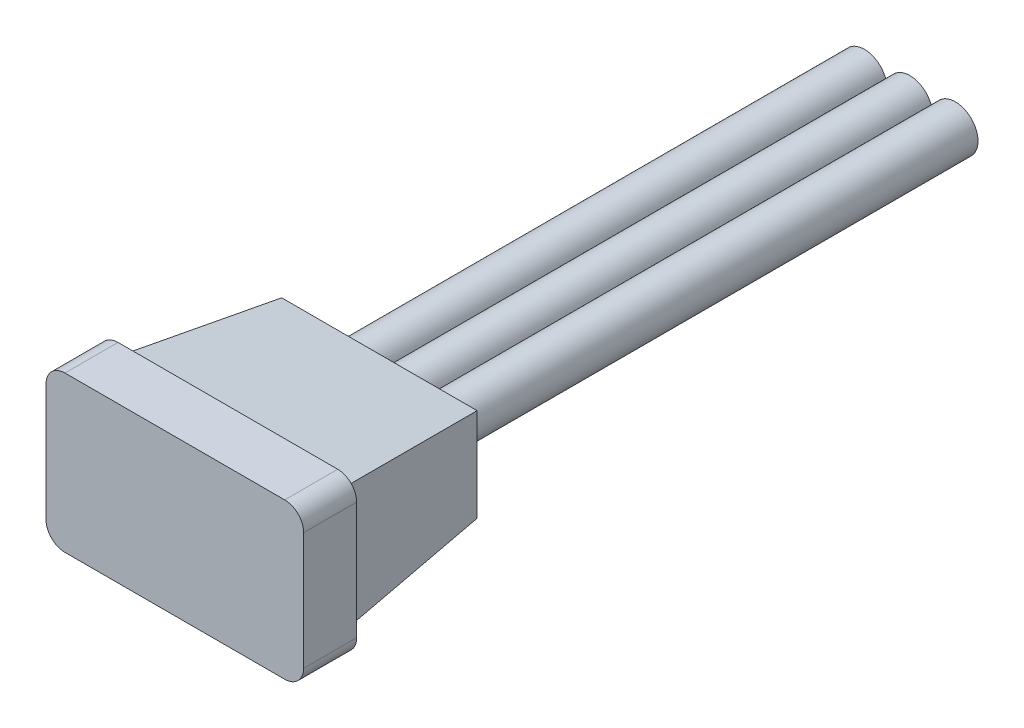
ISO-10303-21;
HEADER;
FILE_DESCRIPTION(('STEP AP214'),'2;1');
FILE_NAME('part.step','',(''),(''),'','','');
FILE_SCHEMA(('AUTOMOTIVE_DESIGN { 1 0 10303 214 1 1 1 1 }'));
ENDSEC;
DATA;
#1=APPLICATION_CONTEXT('core data for automotive mechanical design processes');
#2=APPLICATION_PROTOCOL_DEFINITION('international standard','automotive_design',2000,#1);
#3=PRODUCT_CONTEXT('',#1,'mechanical');
#4=PRODUCT('Part','Part','',(#3));
#5=PRODUCT_RELATED_PRODUCT_CATEGORY('part','',(#4));
#6=PRODUCT_DEFINITION_FORMATION('','',#4);
#7=PRODUCT_DEFINITION_CONTEXT('part definition',#1,'design');
#8=PRODUCT_DEFINITION('design','',#6,#7);
#9=PRODUCT_DEFINITION_SHAPE('','',#8);
#10=(LENGTH_UNIT() NAMED_UNIT(*) SI_UNIT(.MILLI.,.METRE.));
#11=(NAMED_UNIT(*) PLANE_ANGLE_UNIT() SI_UNIT($,.RADIAN.));
#12=(NAMED_UNIT(*) SI_UNIT($,.STERADIAN.) SOLID_ANGLE_UNIT());
#13=UNCERTAINTY_MEASURE_WITH_UNIT(LENGTH_MEASURE(1.E-05),#10,'distance_accuracy_value','');
#14=(GEOMETRIC_REPRESENTATION_CONTEXT(3) GLOBAL_UNCERTAINTY_ASSIGNED_CONTEXT((#13)) GLOBAL_UNIT_ASSIGNED_CONTEXT((#10,
#11,#12)) REPRESENTATION_CONTEXT('',''));
#15=CARTESIAN_POINT('',(0.,0.,0.));
#16=DIRECTION('',(0.,0.,1.));
#17=DIRECTION('',(1.,0.,0.));
#18=AXIS2_PLACEMENT_3D('',#15,#16,#17);
#19=CARTESIAN_POINT('',(1.2,0.,-21.0970562748477));
#20=DIRECTION('',(0.,0.,1.));
#21=DIRECTION('',(1.,0.,0.));
#22=AXIS2_PLACEMENT_3D('',#19,#20,#21);
#23=CYLINDRICAL_SURFACE('',#22,0.6);
#24=CARTESIAN_POINT('',(1.2,0.,-5.4));
#25=DIRECTION('',(0.,0.,-1.));
#26=DIRECTION('',(-1.,0.,0.));
#27=AXIS2_PLACEMENT_3D('',#24,#25,#26);
#28=CIRCLE('',#27,0.6);
#29=CARTESIAN_POINT('',(0.6,0.,-5.4));
#30=VERTEX_POINT('',#29);
#31=EDGE_CURVE('E47',#30,#30,#28,.T.);
#32=ORIENTED_EDGE('',*,*,#31,.T.);
#33=EDGE_LOOP('',(#32));
#34=FACE_BOUND('',#33,.T.);
#35=CARTESIAN_POINT('',(1.2,0.,-19.4));
#36=DIRECTION('',(0.,0.,-1.));
#37=DIRECTION('',(-1.,0.,0.));
#38=AXIS2_PLACEMENT_3D('',#35,#36,#37);
#39=CIRCLE('',#38,0.6);
#40=CARTESIAN_POINT('',(0.6,0.,-19.4));
#41=VERTEX_POINT('',#40);
#42=EDGE_CURVE('E11',#41,#41,#39,.T.);
#43=ORIENTED_EDGE('',*,*,#42,.F.);
#44=EDGE_LOOP('',(#43));
#45=FACE_BOUND('',#44,.T.);
#46=ADVANCED_FACE('F40',(#34,#45),#23,.T.);
#47=CARTESIAN_POINT('',(1.2,0.,-5.4));
#48=DIRECTION('',(0.,0.,-1.));
#49=DIRECTION('',(-1.,0.,0.));
#50=AXIS2_PLACEMENT_3D('',#47,#48,#49);
#51=PLANE('',#50);
#52=ORIENTED_EDGE('',*,*,#31,.F.);
#53=EDGE_LOOP('',(#52));
#54=FACE_BOUND('',#53,.T.);
#55=ADVANCED_FACE('F55',(#54),#51,.F.);
#56=CARTESIAN_POINT('',(0.,0.,-19.4));
#57=DIRECTION('',(0.,0.,-1.));
#58=DIRECTION('',(-1.,0.,0.));
#59=AXIS2_PLACEMENT_3D('',#56,#57,#58);
#60=PLANE('',#59);
#61=ORIENTED_EDGE('',*,*,#42,.T.);
#62=EDGE_LOOP('',(#61));
#63=FACE_BOUND('',#62,.T.);
#64=ADVANCED_FACE('F42',(#63),#60,.T.);
#65=CLOSED_SHELL('',(#46,#55,#64));
#66=MANIFOLD_SOLID_BREP('B2',#65);
#67=CARTESIAN_POINT('',(-1.2,0.,-21.0970562748477));
#68=DIRECTION('',(0.,0.,1.));
#69=DIRECTION('',(1.,0.,0.));
#70=AXIS2_PLACEMENT_3D('',#67,#68,#69);
#71=CYLINDRICAL_SURFACE('',#70,0.6);
#72=CARTESIAN_POINT('',(-1.2,0.,-5.4));
#73=DIRECTION('',(0.,0.,-1.));
#74=DIRECTION('',(-1.,0.,0.));
#75=AXIS2_PLACEMENT_3D('',#72,#73,#74);
#76=CIRCLE('',#75,0.6);
#77=CARTESIAN_POINT('',(-1.8,0.,-5.4));
#78=VERTEX_POINT('',#77);
#79=EDGE_CURVE('E96',#78,#78,#76,.T.);
#80=ORIENTED_EDGE('',*,*,#79,.T.);
#81=EDGE_LOOP('',(#80));
#82=FACE_BOUND('',#81,.T.);
#83=CARTESIAN_POINT('',(-1.2,0.,-19.4));
#84=DIRECTION('',(0.,0.,-1.));
#85=DIRECTION('',(-1.,0.,0.));
#86=AXIS2_PLACEMENT_3D('',#83,#84,#85);
#87=CIRCLE('',#86,0.6);
#88=CARTESIAN_POINT('',(-1.8,0.,-19.4));
#89=VERTEX_POINT('',#88);
#90=EDGE_CURVE('E39',#89,#89,#87,.T.);
#91=ORIENTED_EDGE('',*,*,#90,.F.);
#92=EDGE_LOOP('',(#91));
#93=FACE_BOUND('',#92,.T.);
#94=ADVANCED_FACE('F89',(#82,#93),#71,.T.);
#95=CARTESIAN_POINT('',(-1.2,0.,-5.4));
#96=DIRECTION('',(0.,0.,-1.));
#97=DIRECTION('',(-1.,0.,0.));
#98=AXIS2_PLACEMENT_3D('',#95,#96,#97);
#99=PLANE('',#98);
#100=ORIENTED_EDGE('',*,*,#79,.F.);
#101=EDGE_LOOP('',(#100));
#102=FACE_BOUND('',#101,.T.);
#103=ADVANCED_FACE('F104',(#102),#99,.F.);
#104=CARTESIAN_POINT('',(0.,0.,-19.4));
#105=DIRECTION('',(0.,0.,-1.));
#106=DIRECTION('',(-1.,0.,0.));
#107=AXIS2_PLACEMENT_3D('',#104,#105,#106);
#108=PLANE('',#107);
#109=ORIENTED_EDGE('',*,*,#90,.T.);
#110=EDGE_LOOP('',(#109));
#111=FACE_BOUND('',#110,.T.);
#112=ADVANCED_FACE('F91',(#111),#108,.T.);
#113=CLOSED_SHELL('',(#94,#103,#112));
#114=MANIFOLD_SOLID_BREP('B6',#113);
#115=CARTESIAN_POINT('',(0.,0.,-19.4));
#116=DIRECTION('',(0.,0.,1.));
#117=DIRECTION('',(1.,0.,0.));
#118=AXIS2_PLACEMENT_3D('',#115,#116,#117);
#119=CYLINDRICAL_SURFACE('',#118,0.6);
#120=CARTESIAN_POINT('',(0.,0.,-19.4));
#121=DIRECTION('',(0.,0.,-1.));
#122=DIRECTION('',(-1.,0.,0.));
#123=AXIS2_PLACEMENT_3D('',#120,#121,#122);
#124=CIRCLE('',#123,0.6);
#125=CARTESIAN_POINT('',(-0.6,0.,-19.4));
#126=VERTEX_POINT('',#125);
#127=EDGE_CURVE('E88',#126,#126,#124,.T.);
#128=ORIENTED_EDGE('',*,*,#127,.F.);
#129=EDGE_LOOP('',(#128));
#130=FACE_BOUND('',#129,.T.);
#131=CARTESIAN_POINT('',(0.,0.,-5.4));
#132=DIRECTION('',(0.,0.,-1.));
#133=DIRECTION('',(-1.,0.,0.));
#134=AXIS2_PLACEMENT_3D('',#131,#132,#133);
#135=CIRCLE('',#134,0.6);
#136=CARTESIAN_POINT('',(-0.6,0.,-5.4));
#137=VERTEX_POINT('',#136);
#138=EDGE_CURVE('E142',#137,#137,#135,.T.);
#139=ORIENTED_EDGE('',*,*,#138,.T.);
#140=EDGE_LOOP('',(#139));
#141=FACE_BOUND('',#140,.T.);
#142=ADVANCED_FACE('F139',(#130,#141),#119,.T.);
#143=CARTESIAN_POINT('',(0.,0.,-19.4));
#144=DIRECTION('',(0.,0.,-1.));
#145=DIRECTION('',(-1.,0.,0.));
#146=AXIS2_PLACEMENT_3D('',#143,#144,#145);
#147=PLANE('',#146);
#148=ORIENTED_EDGE('',*,*,#127,.T.);
#149=EDGE_LOOP('',(#148));
#150=FACE_BOUND('',#149,.T.);
#151=ADVANCED_FACE('F154',(#150),#147,.T.);
#152=CARTESIAN_POINT('',(0.,0.,-5.4));
#153=DIRECTION('',(0.,0.,-1.));
#154=DIRECTION('',(-1.,0.,0.));
#155=AXIS2_PLACEMENT_3D('',#152,#153,#154);
#156=PLANE('',#155);
#157=ORIENTED_EDGE('',*,*,#138,.F.);
#158=EDGE_LOOP('',(#157));
#159=FACE_BOUND('',#158,.T.);
#160=ADVANCED_FACE('F152',(#159),#156,.F.);
#161=CLOSED_SHELL('',(#142,#151,#160));
#162=MANIFOLD_SOLID_BREP('B34',#161);
#163=CARTESIAN_POINT('',(0.,0.,-1.4));
#164=DIRECTION('',(0.,0.,1.));
#165=DIRECTION('',(1.,0.,0.));
#166=AXIS2_PLACEMENT_3D('',#163,#164,#165);
#167=PLANE('',#166);
#168=DIRECTION('',(1.,0.,0.));
#169=VECTOR('',#168,1.);
#170=CARTESIAN_POINT('',(-3.4,-2.05,-1.4));
#171=LINE('',#170,#169);
#172=CARTESIAN_POINT('',(-2.9,-2.05,-1.4));
#173=VERTEX_POINT('',#172);
#174=CARTESIAN_POINT('',(2.9,-2.05,-1.4));
#175=VERTEX_POINT('',#174);
#176=EDGE_CURVE('E318',#173,#175,#171,.T.);
#177=ORIENTED_EDGE('',*,*,#176,.F.);
#178=CARTESIAN_POINT('',(-2.9,-1.55,-1.4));
#179=DIRECTION('',(0.,0.,1.));
#180=DIRECTION('',(1.,0.,0.));
#181=AXIS2_PLACEMENT_3D('',#178,#179,#180);
#182=CIRCLE('',#181,0.5);
#183=CARTESIAN_POINT('',(-3.4,-1.55,-1.4));
#184=VERTEX_POINT('',#183);
#185=EDGE_CURVE('E355',#173,#184,#182,.F.);
#186=ORIENTED_EDGE('',*,*,#185,.T.);
#187=DIRECTION('',(0.,-1.,0.));
#188=VECTOR('',#187,1.);
#189=CARTESIAN_POINT('',(-3.4,2.05,-1.4));
#190=LINE('',#189,#188);
#191=CARTESIAN_POINT('',(-3.4,1.55,-1.4));
#192=VERTEX_POINT('',#191);
#193=EDGE_CURVE('E315',#192,#184,#190,.T.);
#194=ORIENTED_EDGE('',*,*,#193,.F.);
#195=CARTESIAN_POINT('',(-2.9,1.55,-1.4));
#196=DIRECTION('',(0.,0.,1.));
#197=DIRECTION('',(1.,0.,0.));
#198=AXIS2_PLACEMENT_3D('',#195,#196,#197);
#199=CIRCLE('',#198,0.5);
#200=CARTESIAN_POINT('',(-2.9,2.05,-1.4));
#201=VERTEX_POINT('',#200);
#202=EDGE_CURVE('E195',#192,#201,#199,.F.);
#203=ORIENTED_EDGE('',*,*,#202,.T.);
#204=DIRECTION('',(-1.,0.,0.));
#205=VECTOR('',#204,1.);
#206=CARTESIAN_POINT('',(-3.4,2.05,-1.4));
#207=LINE('',#206,#205);
#208=CARTESIAN_POINT('',(2.9,2.05,-1.4));
#209=VERTEX_POINT('',#208);
#210=EDGE_CURVE('E312',#209,#201,#207,.T.);
#211=ORIENTED_EDGE('',*,*,#210,.F.);
#212=CARTESIAN_POINT('',(2.9,1.55,-1.4));
#213=DIRECTION('',(0.,0.,1.));
#214=DIRECTION('',(1.,0.,0.));
#215=AXIS2_PLACEMENT_3D('',#212,#213,#214);
#216=CIRCLE('',#215,0.5);
#217=CARTESIAN_POINT('',(3.4,1.55,-1.4));
#218=VERTEX_POINT('',#217);
#219=EDGE_CURVE('E350',#209,#218,#216,.F.);
#220=ORIENTED_EDGE('',*,*,#219,.T.);
#221=DIRECTION('',(0.,1.,0.));
#222=VECTOR('',#221,1.);
#223=CARTESIAN_POINT('',(3.4,2.05,-1.4));
#224=LINE('',#223,#222);
#225=CARTESIAN_POINT('',(3.4,-1.55,-1.4));
#226=VERTEX_POINT('',#225);
#227=EDGE_CURVE('E309',#226,#218,#224,.T.);
#228=ORIENTED_EDGE('',*,*,#227,.F.);
#229=CARTESIAN_POINT('',(2.9,-1.55,-1.4));
#230=DIRECTION('',(0.,0.,1.));
#231=DIRECTION('',(1.,0.,0.));
#232=AXIS2_PLACEMENT_3D('',#229,#230,#231);
#233=CIRCLE('',#232,0.5);
#234=EDGE_CURVE('E352',#226,#175,#233,.F.);
#235=ORIENTED_EDGE('',*,*,#234,.T.);
#236=EDGE_LOOP('',(#177,#186,#194,#203,#211,#220,#228,#235));
#237=FACE_BOUND('',#236,.T.);
#238=DIRECTION('',(0.,-1.,0.));
#239=VECTOR('',#238,1.);
#240=CARTESIAN_POINT('',(3.,1.65,-1.4));
#241=LINE('',#240,#239);
#242=CARTESIAN_POINT('',(3.,1.65,-1.4));
#243=VERTEX_POINT('',#242);
#244=CARTESIAN_POINT('',(3.,-1.65,-1.4));
#245=VERTEX_POINT('',#244);
#246=EDGE_CURVE('E269',#243,#245,#241,.T.);
#247=ORIENTED_EDGE('',*,*,#246,.F.);
#248=DIRECTION('',(1.,0.,0.));
#249=VECTOR('',#248,1.);
#250=CARTESIAN_POINT('',(-3.,1.65,-1.4));
#251=LINE('',#250,#249);
#252=CARTESIAN_POINT('',(-3.,1.65,-1.4));
#253=VERTEX_POINT('',#252);
#254=EDGE_CURVE('E271',#253,#243,#251,.T.);
#255=ORIENTED_EDGE('',*,*,#254,.F.);
#256=DIRECTION('',(0.,1.,0.));
#257=VECTOR('',#256,1.);
#258=CARTESIAN_POINT('',(-3.,1.65,-1.4));
#259=LINE('',#258,#257);
#260=CARTESIAN_POINT('',(-3.,-1.65,-1.4));
#261=VERTEX_POINT('',#260);
#262=EDGE_CURVE('E290',#261,#253,#259,.T.);
#263=ORIENTED_EDGE('',*,*,#262,.F.);
#264=DIRECTION('',(-1.,0.,0.));
#265=VECTOR('',#264,1.);
#266=CARTESIAN_POINT('',(-3.,-1.65,-1.4));
#267=LINE('',#266,#265);
#268=EDGE_CURVE('E274',#245,#261,#267,.T.);
#269=ORIENTED_EDGE('',*,*,#268,.F.);
#270=EDGE_LOOP('',(#247,#255,#263,#269));
#271=FACE_BOUND('',#270,.T.);
#272=ADVANCED_FACE('F180',(#237,#271),#167,.F.);
#273=CARTESIAN_POINT('',(3.4,2.05,-1.4));
#274=DIRECTION('',(1.,0.,0.));
#275=DIRECTION('',(0.,1.,0.));
#276=AXIS2_PLACEMENT_3D('',#273,#274,#275);
#277=PLANE('',#276);
#278=DIRECTION('',(0.,1.,0.));
#279=VECTOR('',#278,1.);
#280=CARTESIAN_POINT('',(3.4,2.05,0.));
#281=LINE('',#280,#279);
#282=CARTESIAN_POINT('',(3.4,-1.55,0.));
#283=VERTEX_POINT('',#282);
#284=CARTESIAN_POINT('',(3.4,1.55,0.));
#285=VERTEX_POINT('',#284);
#286=EDGE_CURVE('E322',#283,#285,#281,.T.);
#287=ORIENTED_EDGE('',*,*,#286,.F.);
#288=DIRECTION('',(0.,0.,1.));
#289=VECTOR('',#288,1.);
#290=CARTESIAN_POINT('',(3.4,-1.55,-1.4));
#291=LINE('',#290,#289);
#292=EDGE_CURVE('E137',#283,#226,#291,.F.);
#293=ORIENTED_EDGE('',*,*,#292,.T.);
#294=ORIENTED_EDGE('',*,*,#227,.T.);
#295=DIRECTION('',(0.,0.,1.));
#296=VECTOR('',#295,1.);
#297=CARTESIAN_POINT('',(3.4,1.55,-1.4));
#298=LINE('',#297,#296);
#299=EDGE_CURVE('E188',#218,#285,#298,.T.);
#300=ORIENTED_EDGE('',*,*,#299,.T.);
#301=EDGE_LOOP('',(#287,#293,#294,#300));
#302=FACE_BOUND('',#301,.T.);
#303=ADVANCED_FACE('F364',(#302),#277,.T.);
#304=CARTESIAN_POINT('',(-3.4,-2.05,-1.4));
#305=DIRECTION('',(0.,-1.,0.));
#306=DIRECTION('',(0.,0.,-1.));
#307=AXIS2_PLACEMENT_3D('',#304,#305,#306);
#308=PLANE('',#307);
#309=DIRECTION('',(1.,0.,0.));
#310=VECTOR('',#309,1.);
#311=CARTESIAN_POINT('',(-3.4,-2.05,0.));
#312=LINE('',#311,#310);
#313=CARTESIAN_POINT('',(-2.9,-2.05,0.));
#314=VERTEX_POINT('',#313);
#315=CARTESIAN_POINT('',(2.9,-2.05,0.));
#316=VERTEX_POINT('',#315);
#317=EDGE_CURVE('E313',#314,#316,#312,.T.);
#318=ORIENTED_EDGE('',*,*,#317,.F.);
#319=DIRECTION('',(0.,0.,1.));
#320=VECTOR('',#319,1.);
#321=CARTESIAN_POINT('',(-2.9,-2.05,-1.4));
#322=LINE('',#321,#320);
#323=EDGE_CURVE('E348',#314,#173,#322,.F.);
#324=ORIENTED_EDGE('',*,*,#323,.T.);
#325=ORIENTED_EDGE('',*,*,#176,.T.);
#326=DIRECTION('',(0.,0.,1.));
#327=VECTOR('',#326,1.);
#328=CARTESIAN_POINT('',(2.9,-2.05,-1.4));
#329=LINE('',#328,#327);
#330=EDGE_CURVE('E345',#175,#316,#329,.T.);
#331=ORIENTED_EDGE('',*,*,#330,.T.);
#332=EDGE_LOOP('',(#318,#324,#325,#331));
#333=FACE_BOUND('',#332,.T.);
#334=ADVANCED_FACE('F377',(#333),#308,.T.);
#335=CARTESIAN_POINT('',(-3.4,2.05,-1.4));
#336=DIRECTION('',(-1.,0.,0.));
#337=DIRECTION('',(0.,-1.,0.));
#338=AXIS2_PLACEMENT_3D('',#335,#336,#337);
#339=PLANE('',#338);
#340=ORIENTED_EDGE('',*,*,#193,.T.);
#341=DIRECTION('',(0.,0.,1.));
#342=VECTOR('',#341,1.);
#343=CARTESIAN_POINT('',(-3.4,-1.55,-1.4));
#344=LINE('',#343,#342);
#345=CARTESIAN_POINT('',(-3.4,-1.55,0.));
#346=VERTEX_POINT('',#345);
#347=EDGE_CURVE('E334',#184,#346,#344,.T.);
#348=ORIENTED_EDGE('',*,*,#347,.T.);
#349=DIRECTION('',(0.,-1.,0.));
#350=VECTOR('',#349,1.);
#351=CARTESIAN_POINT('',(-3.4,2.05,0.));
#352=LINE('',#351,#350);
#353=CARTESIAN_POINT('',(-3.4,1.55,0.));
#354=VERTEX_POINT('',#353);
#355=EDGE_CURVE('E328',#354,#346,#352,.T.);
#356=ORIENTED_EDGE('',*,*,#355,.F.);
#357=DIRECTION('',(0.,0.,1.));
#358=VECTOR('',#357,1.);
#359=CARTESIAN_POINT('',(-3.4,1.55,-1.4));
#360=LINE('',#359,#358);
#361=EDGE_CURVE('E321',#354,#192,#360,.F.);
#362=ORIENTED_EDGE('',*,*,#361,.T.);
#363=EDGE_LOOP('',(#340,#348,#356,#362));
#364=FACE_BOUND('',#363,.T.);
#365=ADVANCED_FACE('F386',(#364),#339,.T.);
#366=CARTESIAN_POINT('',(-3.4,2.05,-1.4));
#367=DIRECTION('',(0.,1.,0.));
#368=DIRECTION('',(0.,0.,1.));
#369=AXIS2_PLACEMENT_3D('',#366,#367,#368);
#370=PLANE('',#369);
#371=ORIENTED_EDGE('',*,*,#210,.T.);
#372=DIRECTION('',(0.,0.,1.));
#373=VECTOR('',#372,1.);
#374=CARTESIAN_POINT('',(-2.9,2.05,-1.4));
#375=LINE('',#374,#373);
#376=CARTESIAN_POINT('',(-2.9,2.05,0.));
#377=VERTEX_POINT('',#376);
#378=EDGE_CURVE('E358',#201,#377,#375,.T.);
#379=ORIENTED_EDGE('',*,*,#378,.T.);
#380=DIRECTION('',(-1.,0.,0.));
#381=VECTOR('',#380,1.);
#382=CARTESIAN_POINT('',(-3.4,2.05,0.));
#383=LINE('',#382,#381);
#384=CARTESIAN_POINT('',(2.9,2.05,0.));
#385=VERTEX_POINT('',#384);
#386=EDGE_CURVE('E325',#385,#377,#383,.T.);
#387=ORIENTED_EDGE('',*,*,#386,.F.);
#388=DIRECTION('',(0.,0.,1.));
#389=VECTOR('',#388,1.);
#390=CARTESIAN_POINT('',(2.9,2.05,-1.4));
#391=LINE('',#390,#389);
#392=EDGE_CURVE('E202',#385,#209,#391,.F.);
#393=ORIENTED_EDGE('',*,*,#392,.T.);
#394=EDGE_LOOP('',(#371,#379,#387,#393));
#395=FACE_BOUND('',#394,.T.);
#396=ADVANCED_FACE('F391',(#395),#370,.T.);
#397=CARTESIAN_POINT('',(0.,0.,0.));
#398=DIRECTION('',(0.,0.,1.));
#399=DIRECTION('',(1.,0.,0.));
#400=AXIS2_PLACEMENT_3D('',#397,#398,#399);
#401=PLANE('',#400);
#402=ORIENTED_EDGE('',*,*,#355,.T.);
#403=CARTESIAN_POINT('',(-2.9,-1.55,0.));
#404=DIRECTION('',(0.,0.,1.));
#405=DIRECTION('',(1.,0.,0.));
#406=AXIS2_PLACEMENT_3D('',#403,#404,#405);
#407=CIRCLE('',#406,0.5);
#408=EDGE_CURVE('E343',#346,#314,#407,.T.);
#409=ORIENTED_EDGE('',*,*,#408,.T.);
#410=ORIENTED_EDGE('',*,*,#317,.T.);
#411=CARTESIAN_POINT('',(2.9,-1.55,0.));
#412=DIRECTION('',(0.,0.,1.));
#413=DIRECTION('',(1.,0.,0.));
#414=AXIS2_PLACEMENT_3D('',#411,#412,#413);
#415=CIRCLE('',#414,0.5);
#416=EDGE_CURVE('E339',#316,#283,#415,.T.);
#417=ORIENTED_EDGE('',*,*,#416,.T.);
#418=ORIENTED_EDGE('',*,*,#286,.T.);
#419=CARTESIAN_POINT('',(2.9,1.55,0.));
#420=DIRECTION('',(0.,0.,1.));
#421=DIRECTION('',(1.,0.,0.));
#422=AXIS2_PLACEMENT_3D('',#419,#420,#421);
#423=CIRCLE('',#422,0.5);
#424=EDGE_CURVE('E337',#285,#385,#423,.T.);
#425=ORIENTED_EDGE('',*,*,#424,.T.);
#426=ORIENTED_EDGE('',*,*,#386,.T.);
#427=CARTESIAN_POINT('',(-2.9,1.55,0.));
#428=DIRECTION('',(0.,0.,1.));
#429=DIRECTION('',(1.,0.,0.));
#430=AXIS2_PLACEMENT_3D('',#427,#428,#429);
#431=CIRCLE('',#430,0.5);
#432=EDGE_CURVE('E341',#377,#354,#431,.T.);
#433=ORIENTED_EDGE('',*,*,#432,.T.);
#434=EDGE_LOOP('',(#402,#409,#410,#417,#418,#425,#426,#433));
#435=FACE_BOUND('',#434,.T.);
#436=ADVANCED_FACE('F370',(#435),#401,.T.);
#437=CARTESIAN_POINT('',(3.,1.65,-1.4));
#438=DIRECTION('',(0.994521895368273,0.,-0.104528463267654));
#439=DIRECTION('',(-0.104528463267654,0.,-0.994521895368273));
#440=AXIS2_PLACEMENT_3D('',#437,#438,#439);
#441=PLANE('',#440);
#442=ORIENTED_EDGE('',*,*,#246,.T.);
#443=DIRECTION('',(0.103962051184498,-0.103962051184498,0.989132844377854));
#444=VECTOR('',#443,1.);
#445=CARTESIAN_POINT('',(2.93515135148107,-1.58515135148107,-2.01699367637287));
#446=LINE('',#445,#444);
#447=CARTESIAN_POINT('',(2.57958305893729,-1.22958305893729,-5.4));
#448=VERTEX_POINT('',#447);
#449=EDGE_CURVE('E301',#448,#245,#446,.T.);
#450=ORIENTED_EDGE('',*,*,#449,.F.);
#451=DIRECTION('',(0.,1.,0.));
#452=VECTOR('',#451,1.);
#453=CARTESIAN_POINT('',(2.57958305893729,0.,-5.4));
#454=LINE('',#453,#452);
#455=CARTESIAN_POINT('',(2.57958305893729,1.22958305893729,-5.4));
#456=VERTEX_POINT('',#455);
#457=EDGE_CURVE('E289',#456,#448,#454,.F.);
#458=ORIENTED_EDGE('',*,*,#457,.F.);
#459=DIRECTION('',(0.103962051184498,0.103962051184498,0.989132844377854));
#460=VECTOR('',#459,1.);
#461=CARTESIAN_POINT('',(3.,1.65,-1.4));
#462=LINE('',#461,#460);
#463=EDGE_CURVE('E285',#456,#243,#462,.T.);
#464=ORIENTED_EDGE('',*,*,#463,.T.);
#465=EDGE_LOOP('',(#442,#450,#458,#464));
#466=FACE_BOUND('',#465,.T.);
#467=ADVANCED_FACE('F292',(#466),#441,.T.);
#468=CARTESIAN_POINT('',(-3.,-1.65,-1.4));
#469=DIRECTION('',(0.,-0.994521895368273,-0.104528463267654));
#470=DIRECTION('',(0.,0.104528463267654,-0.994521895368273));
#471=AXIS2_PLACEMENT_3D('',#468,#469,#470);
#472=PLANE('',#471);
#473=ORIENTED_EDGE('',*,*,#268,.T.);
#474=DIRECTION('',(-0.103962051184498,-0.103962051184498,0.989132844377854));
#475=VECTOR('',#474,1.);
#476=CARTESIAN_POINT('',(-2.96433324331459,-1.61433324331459,-1.73934652200508));
#477=LINE('',#476,#475);
#478=CARTESIAN_POINT('',(-2.57958305893729,-1.22958305893729,-5.4));
#479=VERTEX_POINT('',#478);
#480=EDGE_CURVE('E296',#479,#261,#477,.T.);
#481=ORIENTED_EDGE('',*,*,#480,.F.);
#482=DIRECTION('',(1.,0.,0.));
#483=VECTOR('',#482,1.);
#484=CARTESIAN_POINT('',(0.,-1.22958305893729,-5.4));
#485=LINE('',#484,#483);
#486=EDGE_CURVE('E306',#448,#479,#485,.F.);
#487=ORIENTED_EDGE('',*,*,#486,.F.);
#488=ORIENTED_EDGE('',*,*,#449,.T.);
#489=EDGE_LOOP('',(#473,#481,#487,#488));
#490=FACE_BOUND('',#489,.T.);
#491=ADVANCED_FACE('F404',(#490),#472,.T.);
#492=CARTESIAN_POINT('',(-3.,1.65,-1.4));
#493=DIRECTION('',(-0.994521895368273,0.,-0.104528463267654));
#494=DIRECTION('',(-0.104528463267654,0.,0.994521895368273));
#495=AXIS2_PLACEMENT_3D('',#492,#493,#494);
#496=PLANE('',#495);
#497=ORIENTED_EDGE('',*,*,#262,.T.);
#498=DIRECTION('',(-0.103962051184498,0.103962051184498,0.989132844377854));
#499=VECTOR('',#498,1.);
#500=CARTESIAN_POINT('',(-3.,1.65,-1.4));
#501=LINE('',#500,#499);
#502=CARTESIAN_POINT('',(-2.57958305893729,1.22958305893729,-5.4));
#503=VERTEX_POINT('',#502);
#504=EDGE_CURVE('E288',#503,#253,#501,.T.);
#505=ORIENTED_EDGE('',*,*,#504,.F.);
#506=DIRECTION('',(0.,-1.,0.));
#507=VECTOR('',#506,1.);
#508=CARTESIAN_POINT('',(-2.57958305893729,0.,-5.4));
#509=LINE('',#508,#507);
#510=EDGE_CURVE('E298',#479,#503,#509,.F.);
#511=ORIENTED_EDGE('',*,*,#510,.F.);
#512=ORIENTED_EDGE('',*,*,#480,.T.);
#513=EDGE_LOOP('',(#497,#505,#511,#512));
#514=FACE_BOUND('',#513,.T.);
#515=ADVANCED_FACE('F455',(#514),#496,.T.);
#516=CARTESIAN_POINT('',(-3.,1.65,-1.4));
#517=DIRECTION('',(0.,0.994521895368273,-0.104528463267654));
#518=DIRECTION('',(0.,0.104528463267654,0.994521895368273));
#519=AXIS2_PLACEMENT_3D('',#516,#517,#518);
#520=PLANE('',#519);
#521=ORIENTED_EDGE('',*,*,#254,.T.);
#522=ORIENTED_EDGE('',*,*,#463,.F.);
#523=DIRECTION('',(-1.,0.,0.));
#524=VECTOR('',#523,1.);
#525=CARTESIAN_POINT('',(0.,1.22958305893729,-5.4));
#526=LINE('',#525,#524);
#527=EDGE_CURVE('E294',#503,#456,#526,.F.);
#528=ORIENTED_EDGE('',*,*,#527,.F.);
#529=ORIENTED_EDGE('',*,*,#504,.T.);
#530=EDGE_LOOP('',(#521,#522,#528,#529));
#531=FACE_BOUND('',#530,.T.);
#532=ADVANCED_FACE('F283',(#531),#520,.T.);
#533=CARTESIAN_POINT('',(0.,0.,-5.4));
#534=DIRECTION('',(0.,0.,1.));
#535=DIRECTION('',(1.,0.,0.));
#536=AXIS2_PLACEMENT_3D('',#533,#534,#535);
#537=PLANE('',#536);
#538=ORIENTED_EDGE('',*,*,#457,.T.);
#539=ORIENTED_EDGE('',*,*,#486,.T.);
#540=ORIENTED_EDGE('',*,*,#510,.T.);
#541=ORIENTED_EDGE('',*,*,#527,.T.);
#542=EDGE_LOOP('',(#538,#539,#540,#541));
#543=FACE_BOUND('',#542,.T.);
#544=ADVANCED_FACE('F416',(#543),#537,.F.);
#545=CARTESIAN_POINT('',(-2.9,-1.55,-1.4));
#546=DIRECTION('',(0.,0.,1.));
#547=DIRECTION('',(1.,0.,0.));
#548=AXIS2_PLACEMENT_3D('',#545,#546,#547);
#549=CYLINDRICAL_SURFACE('',#548,0.5);
#550=ORIENTED_EDGE('',*,*,#185,.F.);
#551=ORIENTED_EDGE('',*,*,#323,.F.);
#552=ORIENTED_EDGE('',*,*,#408,.F.);
#553=ORIENTED_EDGE('',*,*,#347,.F.);
#554=EDGE_LOOP('',(#550,#551,#552,#553));
#555=FACE_BOUND('',#554,.T.);
#556=ADVANCED_FACE('F383',(#555),#549,.T.);
#557=CARTESIAN_POINT('',(-2.9,1.55,-1.4));
#558=DIRECTION('',(0.,0.,1.));
#559=DIRECTION('',(1.,0.,0.));
#560=AXIS2_PLACEMENT_3D('',#557,#558,#559);
#561=CYLINDRICAL_SURFACE('',#560,0.5);
#562=ORIENTED_EDGE('',*,*,#202,.F.);
#563=ORIENTED_EDGE('',*,*,#361,.F.);
#564=ORIENTED_EDGE('',*,*,#432,.F.);
#565=ORIENTED_EDGE('',*,*,#378,.F.);
#566=EDGE_LOOP('',(#562,#563,#564,#565));
#567=FACE_BOUND('',#566,.T.);
#568=ADVANCED_FACE('F390',(#567),#561,.T.);
#569=CARTESIAN_POINT('',(2.9,-1.55,-1.4));
#570=DIRECTION('',(0.,0.,1.));
#571=DIRECTION('',(1.,0.,0.));
#572=AXIS2_PLACEMENT_3D('',#569,#570,#571);
#573=CYLINDRICAL_SURFACE('',#572,0.5);
#574=ORIENTED_EDGE('',*,*,#234,.F.);
#575=ORIENTED_EDGE('',*,*,#292,.F.);
#576=ORIENTED_EDGE('',*,*,#416,.F.);
#577=ORIENTED_EDGE('',*,*,#330,.F.);
#578=EDGE_LOOP('',(#574,#575,#576,#577));
#579=FACE_BOUND('',#578,.T.);
#580=ADVANCED_FACE('F375',(#579),#573,.T.);
#581=CARTESIAN_POINT('',(2.9,1.55,-1.4));
#582=DIRECTION('',(0.,0.,1.));
#583=DIRECTION('',(1.,0.,0.));
#584=AXIS2_PLACEMENT_3D('',#581,#582,#583);
#585=CYLINDRICAL_SURFACE('',#584,0.5);
#586=ORIENTED_EDGE('',*,*,#219,.F.);
#587=ORIENTED_EDGE('',*,*,#392,.F.);
#588=ORIENTED_EDGE('',*,*,#424,.F.);
#589=ORIENTED_EDGE('',*,*,#299,.F.);
#590=EDGE_LOOP('',(#586,#587,#588,#589));
#591=FACE_BOUND('',#590,.T.);
#592=ADVANCED_FACE('F182',(#591),#585,.T.);
#593=CLOSED_SHELL('',(#272,#303,#334,#365,#396,#436,#467,#491,#515,#532,#544,#556,#568,#580,#592));
#594=MANIFOLD_SOLID_BREP('B83',#593);
#595=ADVANCED_BREP_SHAPE_REPRESENTATION('',(#18,#66,#114,#162,#594),#14);
#596=SHAPE_DEFINITION_REPRESENTATION(#9,#595);
ENDSEC;
END-ISO-10303-21;
